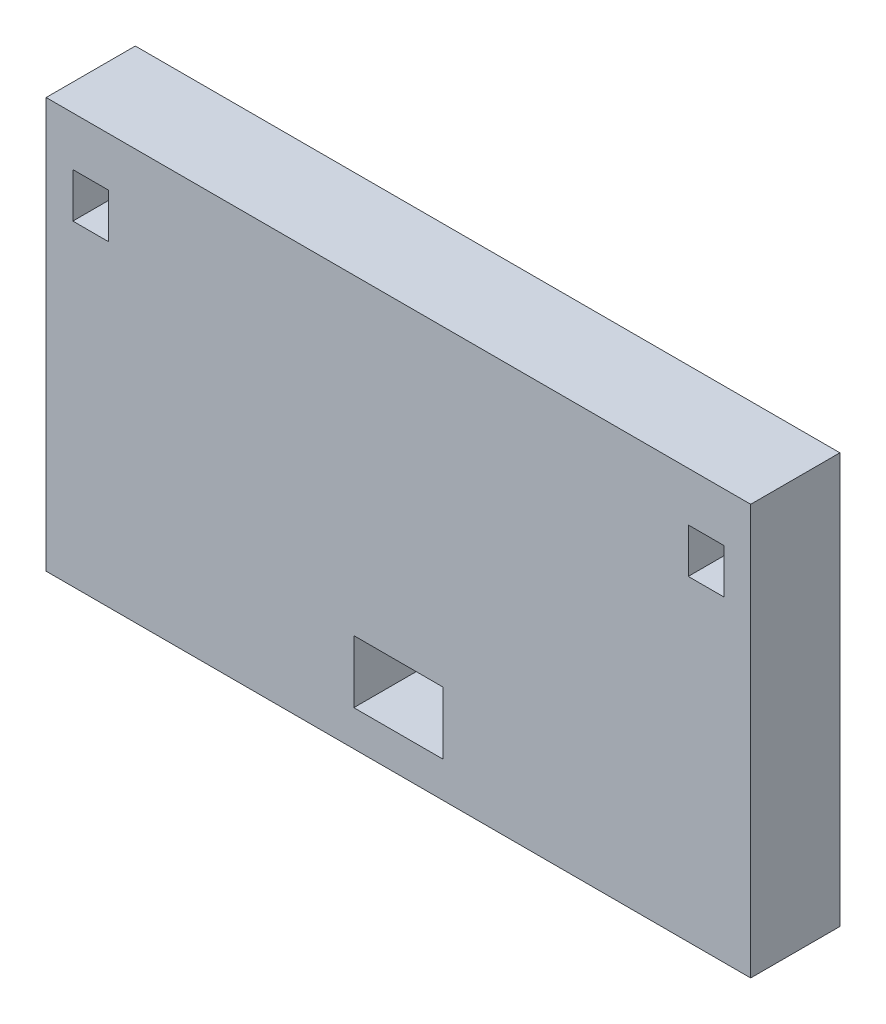
ISO-10303-21;
HEADER;
FILE_DESCRIPTION(('STEP AP214'),'2;1');
FILE_NAME('part.step','',(''),(''),'','','');
FILE_SCHEMA(('AUTOMOTIVE_DESIGN { 1 0 10303 214 1 1 1 1 }'));
ENDSEC;
DATA;
#1=APPLICATION_CONTEXT('core data for automotive mechanical design processes');
#2=APPLICATION_PROTOCOL_DEFINITION('international standard','automotive_design',2000,#1);
#3=PRODUCT_CONTEXT('',#1,'mechanical');
#4=PRODUCT('Part','Part','',(#3));
#5=PRODUCT_RELATED_PRODUCT_CATEGORY('part','',(#4));
#6=PRODUCT_DEFINITION_FORMATION('','',#4);
#7=PRODUCT_DEFINITION_CONTEXT('part definition',#1,'design');
#8=PRODUCT_DEFINITION('design','',#6,#7);
#9=PRODUCT_DEFINITION_SHAPE('','',#8);
#10=(LENGTH_UNIT() NAMED_UNIT(*) SI_UNIT(.MILLI.,.METRE.));
#11=(NAMED_UNIT(*) PLANE_ANGLE_UNIT() SI_UNIT($,.RADIAN.));
#12=(NAMED_UNIT(*) SI_UNIT($,.STERADIAN.) SOLID_ANGLE_UNIT());
#13=UNCERTAINTY_MEASURE_WITH_UNIT(LENGTH_MEASURE(1.E-05),#10,'distance_accuracy_value','');
#14=(GEOMETRIC_REPRESENTATION_CONTEXT(3) GLOBAL_UNCERTAINTY_ASSIGNED_CONTEXT((#13)) GLOBAL_UNIT_ASSIGNED_CONTEXT((#10,
#11,#12)) REPRESENTATION_CONTEXT('',''));
#15=CARTESIAN_POINT('',(0.,0.,0.));
#16=DIRECTION('',(0.,0.,1.));
#17=DIRECTION('',(1.,0.,0.));
#18=AXIS2_PLACEMENT_3D('',#15,#16,#17);
#19=CARTESIAN_POINT('',(0.,0.,10.));
#20=DIRECTION('',(0.,0.,-1.));
#21=DIRECTION('',(-1.,0.,0.));
#22=AXIS2_PLACEMENT_3D('',#19,#20,#21);
#23=PLANE('',#22);
#24=DIRECTION('',(0.,1.,0.));
#25=VECTOR('',#24,1.);
#26=CARTESIAN_POINT('',(36.5,33.1073700145429,10.));
#27=LINE('',#26,#25);
#28=CARTESIAN_POINT('',(36.5,33.1073700145429,10.));
#29=VERTEX_POINT('',#28);
#30=CARTESIAN_POINT('',(36.5,38.1073700145429,10.));
#31=VERTEX_POINT('',#30);
#32=EDGE_CURVE('E201',#29,#31,#27,.T.);
#33=ORIENTED_EDGE('',*,*,#32,.F.);
#34=DIRECTION('',(1.,0.,0.));
#35=VECTOR('',#34,1.);
#36=CARTESIAN_POINT('',(32.5,33.1073700145429,10.));
#37=LINE('',#36,#35);
#38=CARTESIAN_POINT('',(32.5,33.1073700145429,10.));
#39=VERTEX_POINT('',#38);
#40=EDGE_CURVE('E212',#39,#29,#37,.T.);
#41=ORIENTED_EDGE('',*,*,#40,.F.);
#42=DIRECTION('',(0.,-1.,0.));
#43=VECTOR('',#42,1.);
#44=CARTESIAN_POINT('',(32.5,33.1073700145429,10.));
#45=LINE('',#44,#43);
#46=CARTESIAN_POINT('',(32.5,38.1073700145429,10.));
#47=VERTEX_POINT('',#46);
#48=EDGE_CURVE('E208',#47,#39,#45,.T.);
#49=ORIENTED_EDGE('',*,*,#48,.F.);
#50=DIRECTION('',(-1.,0.,0.));
#51=VECTOR('',#50,1.);
#52=CARTESIAN_POINT('',(32.5,38.1073700145429,10.));
#53=LINE('',#52,#51);
#54=EDGE_CURVE('E204',#31,#47,#53,.T.);
#55=ORIENTED_EDGE('',*,*,#54,.F.);
#56=EDGE_LOOP('',(#33,#41,#49,#55));
#57=FACE_BOUND('',#56,.T.);
#58=DIRECTION('',(0.,-1.,0.));
#59=VECTOR('',#58,1.);
#60=CARTESIAN_POINT('',(-39.5,-2.38845773558347,10.));
#61=LINE('',#60,#59);
#62=CARTESIAN_POINT('',(-39.5,43.6115422644165,10.));
#63=VERTEX_POINT('',#62);
#64=CARTESIAN_POINT('',(-39.5,-2.38845773558347,10.));
#65=VERTEX_POINT('',#64);
#66=EDGE_CURVE('E287',#63,#65,#61,.T.);
#67=ORIENTED_EDGE('',*,*,#66,.T.);
#68=DIRECTION('',(1.,0.,0.));
#69=VECTOR('',#68,1.);
#70=CARTESIAN_POINT('',(-39.5,-2.38845773558347,10.));
#71=LINE('',#70,#69);
#72=CARTESIAN_POINT('',(39.5,-2.38845773558347,10.));
#73=VERTEX_POINT('',#72);
#74=EDGE_CURVE('E291',#65,#73,#71,.T.);
#75=ORIENTED_EDGE('',*,*,#74,.T.);
#76=DIRECTION('',(0.,1.,0.));
#77=VECTOR('',#76,1.);
#78=CARTESIAN_POINT('',(39.5,-2.38845773558347,10.));
#79=LINE('',#78,#77);
#80=CARTESIAN_POINT('',(39.5,43.6115422644166,10.));
#81=VERTEX_POINT('',#80);
#82=EDGE_CURVE('E295',#73,#81,#79,.T.);
#83=ORIENTED_EDGE('',*,*,#82,.T.);
#84=DIRECTION('',(-1.,0.,0.));
#85=VECTOR('',#84,1.);
#86=CARTESIAN_POINT('',(-39.5,43.6115422644165,10.));
#87=LINE('',#86,#85);
#88=EDGE_CURVE('E298',#81,#63,#87,.T.);
#89=ORIENTED_EDGE('',*,*,#88,.T.);
#90=EDGE_LOOP('',(#67,#75,#83,#89));
#91=FACE_BOUND('',#90,.T.);
#92=DIRECTION('',(0.,-1.,0.));
#93=VECTOR('',#92,1.);
#94=CARTESIAN_POINT('',(-5.,1.61154226441653,10.));
#95=LINE('',#94,#93);
#96=CARTESIAN_POINT('',(-5.,8.61154226441653,10.));
#97=VERTEX_POINT('',#96);
#98=CARTESIAN_POINT('',(-5.,1.61154226441653,10.));
#99=VERTEX_POINT('',#98);
#100=EDGE_CURVE('E244',#97,#99,#95,.T.);
#101=ORIENTED_EDGE('',*,*,#100,.F.);
#102=DIRECTION('',(-1.,0.,0.));
#103=VECTOR('',#102,1.);
#104=CARTESIAN_POINT('',(5.,8.61154226441653,10.));
#105=LINE('',#104,#103);
#106=CARTESIAN_POINT('',(5.,8.61154226441654,10.));
#107=VERTEX_POINT('',#106);
#108=EDGE_CURVE('E255',#107,#97,#105,.T.);
#109=ORIENTED_EDGE('',*,*,#108,.F.);
#110=DIRECTION('',(0.,1.,0.));
#111=VECTOR('',#110,1.);
#112=CARTESIAN_POINT('',(5.,1.61154226441654,10.));
#113=LINE('',#112,#111);
#114=CARTESIAN_POINT('',(5.,1.61154226441654,10.));
#115=VERTEX_POINT('',#114);
#116=EDGE_CURVE('E251',#115,#107,#113,.T.);
#117=ORIENTED_EDGE('',*,*,#116,.F.);
#118=DIRECTION('',(1.,0.,0.));
#119=VECTOR('',#118,1.);
#120=CARTESIAN_POINT('',(5.,1.61154226441654,10.));
#121=LINE('',#120,#119);
#122=EDGE_CURVE('E247',#99,#115,#121,.T.);
#123=ORIENTED_EDGE('',*,*,#122,.F.);
#124=EDGE_LOOP('',(#101,#109,#117,#123));
#125=FACE_BOUND('',#124,.T.);
#126=DIRECTION('',(0.,1.,0.));
#127=VECTOR('',#126,1.);
#128=CARTESIAN_POINT('',(-32.5,33.1073700145429,10.));
#129=LINE('',#128,#127);
#130=CARTESIAN_POINT('',(-32.5,33.1073700145429,10.));
#131=VERTEX_POINT('',#130);
#132=CARTESIAN_POINT('',(-32.5,38.1115422644165,10.));
#133=VERTEX_POINT('',#132);
#134=EDGE_CURVE('E153',#131,#133,#129,.T.);
#135=ORIENTED_EDGE('',*,*,#134,.F.);
#136=DIRECTION('',(0.999999456010787,-0.00104306190098296,0.));
#137=VECTOR('',#136,1.);
#138=CARTESIAN_POINT('',(-32.5,33.1073700145429,10.));
#139=LINE('',#138,#137);
#140=CARTESIAN_POINT('',(-36.5,33.1115422644165,10.));
#141=VERTEX_POINT('',#140);
#142=EDGE_CURVE('E179',#141,#131,#139,.T.);
#143=ORIENTED_EDGE('',*,*,#142,.F.);
#144=DIRECTION('',(0.,-1.,0.));
#145=VECTOR('',#144,1.);
#146=CARTESIAN_POINT('',(-36.5,33.1115422644165,10.));
#147=LINE('',#146,#145);
#148=CARTESIAN_POINT('',(-36.5,38.1115422644165,10.));
#149=VERTEX_POINT('',#148);
#150=EDGE_CURVE('E175',#149,#141,#147,.T.);
#151=ORIENTED_EDGE('',*,*,#150,.F.);
#152=DIRECTION('',(-1.,0.,0.));
#153=VECTOR('',#152,1.);
#154=CARTESIAN_POINT('',(-32.5,38.1115422644165,10.));
#155=LINE('',#154,#153);
#156=EDGE_CURVE('E162',#133,#149,#155,.T.);
#157=ORIENTED_EDGE('',*,*,#156,.F.);
#158=EDGE_LOOP('',(#135,#143,#151,#157));
#159=FACE_BOUND('',#158,.T.);
#160=ADVANCED_FACE('F39',(#57,#91,#125,#159),#23,.F.);
#161=CARTESIAN_POINT('',(0.,0.,0.));
#162=DIRECTION('',(0.,0.,-1.));
#163=DIRECTION('',(-1.,0.,0.));
#164=AXIS2_PLACEMENT_3D('',#161,#162,#163);
#165=PLANE('',#164);
#166=DIRECTION('',(0.,-1.,0.));
#167=VECTOR('',#166,1.);
#168=CARTESIAN_POINT('',(-39.5,-2.38845773558347,0.));
#169=LINE('',#168,#167);
#170=CARTESIAN_POINT('',(-39.5,43.6115422644165,0.));
#171=VERTEX_POINT('',#170);
#172=CARTESIAN_POINT('',(-39.5,-2.38845773558347,0.));
#173=VERTEX_POINT('',#172);
#174=EDGE_CURVE('E286',#171,#173,#169,.T.);
#175=ORIENTED_EDGE('',*,*,#174,.F.);
#176=DIRECTION('',(-1.,0.,0.));
#177=VECTOR('',#176,1.);
#178=CARTESIAN_POINT('',(-39.5,43.6115422644165,0.));
#179=LINE('',#178,#177);
#180=CARTESIAN_POINT('',(39.5,43.6115422644166,0.));
#181=VERTEX_POINT('',#180);
#182=EDGE_CURVE('E292',#181,#171,#179,.T.);
#183=ORIENTED_EDGE('',*,*,#182,.F.);
#184=DIRECTION('',(0.,1.,0.));
#185=VECTOR('',#184,1.);
#186=CARTESIAN_POINT('',(39.5,-2.38845773558347,0.));
#187=LINE('',#186,#185);
#188=CARTESIAN_POINT('',(39.5,-2.38845773558347,0.));
#189=VERTEX_POINT('',#188);
#190=EDGE_CURVE('E308',#189,#181,#187,.T.);
#191=ORIENTED_EDGE('',*,*,#190,.F.);
#192=DIRECTION('',(1.,0.,0.));
#193=VECTOR('',#192,1.);
#194=CARTESIAN_POINT('',(-39.5,-2.38845773558347,0.));
#195=LINE('',#194,#193);
#196=EDGE_CURVE('E305',#173,#189,#195,.T.);
#197=ORIENTED_EDGE('',*,*,#196,.F.);
#198=EDGE_LOOP('',(#175,#183,#191,#197));
#199=FACE_BOUND('',#198,.T.);
#200=DIRECTION('',(-1.,0.,0.));
#201=VECTOR('',#200,1.);
#202=CARTESIAN_POINT('',(5.,8.61154226441653,0.));
#203=LINE('',#202,#201);
#204=CARTESIAN_POINT('',(5.,8.61154226441653,0.));
#205=VERTEX_POINT('',#204);
#206=CARTESIAN_POINT('',(-5.,8.61154226441653,0.));
#207=VERTEX_POINT('',#206);
#208=EDGE_CURVE('E248',#205,#207,#203,.T.);
#209=ORIENTED_EDGE('',*,*,#208,.T.);
#210=DIRECTION('',(0.,-1.,0.));
#211=VECTOR('',#210,1.);
#212=CARTESIAN_POINT('',(-5.,1.61154226441653,0.));
#213=LINE('',#212,#211);
#214=CARTESIAN_POINT('',(-5.,1.61154226441653,0.));
#215=VERTEX_POINT('',#214);
#216=EDGE_CURVE('E243',#207,#215,#213,.T.);
#217=ORIENTED_EDGE('',*,*,#216,.T.);
#218=DIRECTION('',(1.,0.,0.));
#219=VECTOR('',#218,1.);
#220=CARTESIAN_POINT('',(5.,1.61154226441654,0.));
#221=LINE('',#220,#219);
#222=CARTESIAN_POINT('',(5.,1.61154226441654,0.));
#223=VERTEX_POINT('',#222);
#224=EDGE_CURVE('E262',#215,#223,#221,.T.);
#225=ORIENTED_EDGE('',*,*,#224,.T.);
#226=DIRECTION('',(0.,1.,0.));
#227=VECTOR('',#226,1.);
#228=CARTESIAN_POINT('',(5.,1.61154226441654,0.));
#229=LINE('',#228,#227);
#230=EDGE_CURVE('E266',#223,#205,#229,.T.);
#231=ORIENTED_EDGE('',*,*,#230,.T.);
#232=EDGE_LOOP('',(#209,#217,#225,#231));
#233=FACE_BOUND('',#232,.T.);
#234=DIRECTION('',(1.,0.,0.));
#235=VECTOR('',#234,1.);
#236=CARTESIAN_POINT('',(32.5,33.1073700145429,0.));
#237=LINE('',#236,#235);
#238=CARTESIAN_POINT('',(32.5,33.1073700145429,0.));
#239=VERTEX_POINT('',#238);
#240=CARTESIAN_POINT('',(36.5,33.1073700145429,0.));
#241=VERTEX_POINT('',#240);
#242=EDGE_CURVE('E205',#239,#241,#237,.T.);
#243=ORIENTED_EDGE('',*,*,#242,.T.);
#244=DIRECTION('',(0.,1.,0.));
#245=VECTOR('',#244,1.);
#246=CARTESIAN_POINT('',(36.5,33.1073700145429,0.));
#247=LINE('',#246,#245);
#248=CARTESIAN_POINT('',(36.5,38.1073700145429,0.));
#249=VERTEX_POINT('',#248);
#250=EDGE_CURVE('E171',#241,#249,#247,.T.);
#251=ORIENTED_EDGE('',*,*,#250,.T.);
#252=DIRECTION('',(-1.,0.,0.));
#253=VECTOR('',#252,1.);
#254=CARTESIAN_POINT('',(32.5,38.1073700145429,0.));
#255=LINE('',#254,#253);
#256=CARTESIAN_POINT('',(32.5,38.1073700145429,0.));
#257=VERTEX_POINT('',#256);
#258=EDGE_CURVE('E219',#249,#257,#255,.T.);
#259=ORIENTED_EDGE('',*,*,#258,.T.);
#260=DIRECTION('',(0.,-1.,0.));
#261=VECTOR('',#260,1.);
#262=CARTESIAN_POINT('',(32.5,33.1073700145429,0.));
#263=LINE('',#262,#261);
#264=EDGE_CURVE('E223',#257,#239,#263,.T.);
#265=ORIENTED_EDGE('',*,*,#264,.T.);
#266=EDGE_LOOP('',(#243,#251,#259,#265));
#267=FACE_BOUND('',#266,.T.);
#268=DIRECTION('',(0.999999456010787,-0.00104306190098296,0.));
#269=VECTOR('',#268,1.);
#270=CARTESIAN_POINT('',(-32.5,33.1073700145429,0.));
#271=LINE('',#270,#269);
#272=CARTESIAN_POINT('',(-36.5,33.1115422644165,0.));
#273=VERTEX_POINT('',#272);
#274=CARTESIAN_POINT('',(-32.5,33.1073700145429,0.));
#275=VERTEX_POINT('',#274);
#276=EDGE_CURVE('E163',#273,#275,#271,.T.);
#277=ORIENTED_EDGE('',*,*,#276,.T.);
#278=DIRECTION('',(0.,1.,0.));
#279=VECTOR('',#278,1.);
#280=CARTESIAN_POINT('',(-32.5,33.1073700145429,0.));
#281=LINE('',#280,#279);
#282=CARTESIAN_POINT('',(-32.5,38.1115422644165,0.));
#283=VERTEX_POINT('',#282);
#284=EDGE_CURVE('E63',#275,#283,#281,.T.);
#285=ORIENTED_EDGE('',*,*,#284,.T.);
#286=DIRECTION('',(-1.,0.,0.));
#287=VECTOR('',#286,1.);
#288=CARTESIAN_POINT('',(-32.5,38.1115422644165,0.));
#289=LINE('',#288,#287);
#290=CARTESIAN_POINT('',(-36.5,38.1115422644165,0.));
#291=VERTEX_POINT('',#290);
#292=EDGE_CURVE('E169',#283,#291,#289,.T.);
#293=ORIENTED_EDGE('',*,*,#292,.T.);
#294=DIRECTION('',(0.,-1.,0.));
#295=VECTOR('',#294,1.);
#296=CARTESIAN_POINT('',(-36.5,33.1115422644165,0.));
#297=LINE('',#296,#295);
#298=EDGE_CURVE('E188',#291,#273,#297,.T.);
#299=ORIENTED_EDGE('',*,*,#298,.T.);
#300=EDGE_LOOP('',(#277,#285,#293,#299));
#301=FACE_BOUND('',#300,.T.);
#302=ADVANCED_FACE('F331',(#199,#233,#267,#301),#165,.T.);
#303=CARTESIAN_POINT('',(-39.5,-2.38845773558347,10.));
#304=DIRECTION('',(1.,0.,0.));
#305=DIRECTION('',(0.,0.,-1.));
#306=AXIS2_PLACEMENT_3D('',#303,#304,#305);
#307=PLANE('',#306);
#308=ORIENTED_EDGE('',*,*,#174,.T.);
#309=DIRECTION('',(0.,0.,-1.));
#310=VECTOR('',#309,1.);
#311=CARTESIAN_POINT('',(-39.5,-2.38845773558347,10.));
#312=LINE('',#311,#310);
#313=EDGE_CURVE('E11',#65,#173,#312,.T.);
#314=ORIENTED_EDGE('',*,*,#313,.F.);
#315=ORIENTED_EDGE('',*,*,#66,.F.);
#316=DIRECTION('',(0.,0.,-1.));
#317=VECTOR('',#316,1.);
#318=CARTESIAN_POINT('',(-39.5,43.6115422644165,10.));
#319=LINE('',#318,#317);
#320=EDGE_CURVE('E301',#63,#171,#319,.T.);
#321=ORIENTED_EDGE('',*,*,#320,.T.);
#322=EDGE_LOOP('',(#308,#314,#315,#321));
#323=FACE_BOUND('',#322,.T.);
#324=ADVANCED_FACE('F41',(#323),#307,.F.);
#325=CARTESIAN_POINT('',(-39.5,-2.38845773558347,10.));
#326=DIRECTION('',(0.,1.,0.));
#327=DIRECTION('',(-1.,0.,0.));
#328=AXIS2_PLACEMENT_3D('',#325,#326,#327);
#329=PLANE('',#328);
#330=ORIENTED_EDGE('',*,*,#196,.T.);
#331=DIRECTION('',(0.,0.,-1.));
#332=VECTOR('',#331,1.);
#333=CARTESIAN_POINT('',(39.5,-2.38845773558347,10.));
#334=LINE('',#333,#332);
#335=EDGE_CURVE('E48',#73,#189,#334,.T.);
#336=ORIENTED_EDGE('',*,*,#335,.F.);
#337=ORIENTED_EDGE('',*,*,#74,.F.);
#338=ORIENTED_EDGE('',*,*,#313,.T.);
#339=EDGE_LOOP('',(#330,#336,#337,#338));
#340=FACE_BOUND('',#339,.T.);
#341=ADVANCED_FACE('F342',(#340),#329,.F.);
#342=CARTESIAN_POINT('',(39.5,-2.38845773558347,10.));
#343=DIRECTION('',(-1.,0.,0.));
#344=DIRECTION('',(0.,0.,1.));
#345=AXIS2_PLACEMENT_3D('',#342,#343,#344);
#346=PLANE('',#345);
#347=ORIENTED_EDGE('',*,*,#190,.T.);
#348=DIRECTION('',(0.,0.,-1.));
#349=VECTOR('',#348,1.);
#350=CARTESIAN_POINT('',(39.5,43.6115422644166,10.));
#351=LINE('',#350,#349);
#352=EDGE_CURVE('E316',#81,#181,#351,.T.);
#353=ORIENTED_EDGE('',*,*,#352,.F.);
#354=ORIENTED_EDGE('',*,*,#82,.F.);
#355=ORIENTED_EDGE('',*,*,#335,.T.);
#356=EDGE_LOOP('',(#347,#353,#354,#355));
#357=FACE_BOUND('',#356,.T.);
#358=ADVANCED_FACE('F325',(#357),#346,.F.);
#359=CARTESIAN_POINT('',(-39.5,43.6115422644165,10.));
#360=DIRECTION('',(0.,-1.,0.));
#361=DIRECTION('',(1.,0.,0.));
#362=AXIS2_PLACEMENT_3D('',#359,#360,#361);
#363=PLANE('',#362);
#364=ORIENTED_EDGE('',*,*,#182,.T.);
#365=ORIENTED_EDGE('',*,*,#320,.F.);
#366=ORIENTED_EDGE('',*,*,#88,.F.);
#367=ORIENTED_EDGE('',*,*,#352,.T.);
#368=EDGE_LOOP('',(#364,#365,#366,#367));
#369=FACE_BOUND('',#368,.T.);
#370=ADVANCED_FACE('F335',(#369),#363,.F.);
#371=CARTESIAN_POINT('',(-5.,1.61154226441653,10.));
#372=DIRECTION('',(1.,0.,0.));
#373=DIRECTION('',(0.,0.,-1.));
#374=AXIS2_PLACEMENT_3D('',#371,#372,#373);
#375=PLANE('',#374);
#376=ORIENTED_EDGE('',*,*,#216,.F.);
#377=DIRECTION('',(0.,0.,-1.));
#378=VECTOR('',#377,1.);
#379=CARTESIAN_POINT('',(-5.,8.61154226441653,10.));
#380=LINE('',#379,#378);
#381=EDGE_CURVE('E258',#97,#207,#380,.T.);
#382=ORIENTED_EDGE('',*,*,#381,.F.);
#383=ORIENTED_EDGE('',*,*,#100,.T.);
#384=DIRECTION('',(0.,0.,-1.));
#385=VECTOR('',#384,1.);
#386=CARTESIAN_POINT('',(-5.,1.61154226441653,10.));
#387=LINE('',#386,#385);
#388=EDGE_CURVE('E282',#99,#215,#387,.T.);
#389=ORIENTED_EDGE('',*,*,#388,.T.);
#390=EDGE_LOOP('',(#376,#382,#383,#389));
#391=FACE_BOUND('',#390,.T.);
#392=ADVANCED_FACE('F358',(#391),#375,.T.);
#393=CARTESIAN_POINT('',(5.,1.61154226441654,10.));
#394=DIRECTION('',(0.,1.,0.));
#395=DIRECTION('',(-1.,0.,0.));
#396=AXIS2_PLACEMENT_3D('',#393,#394,#395);
#397=PLANE('',#396);
#398=ORIENTED_EDGE('',*,*,#224,.F.);
#399=ORIENTED_EDGE('',*,*,#388,.F.);
#400=ORIENTED_EDGE('',*,*,#122,.T.);
#401=DIRECTION('',(0.,0.,-1.));
#402=VECTOR('',#401,1.);
#403=CARTESIAN_POINT('',(5.,1.61154226441654,10.));
#404=LINE('',#403,#402);
#405=EDGE_CURVE('E279',#115,#223,#404,.T.);
#406=ORIENTED_EDGE('',*,*,#405,.T.);
#407=EDGE_LOOP('',(#398,#399,#400,#406));
#408=FACE_BOUND('',#407,.T.);
#409=ADVANCED_FACE('F365',(#408),#397,.T.);
#410=CARTESIAN_POINT('',(5.,1.61154226441654,10.));
#411=DIRECTION('',(-1.,0.,0.));
#412=DIRECTION('',(0.,0.,1.));
#413=AXIS2_PLACEMENT_3D('',#410,#411,#412);
#414=PLANE('',#413);
#415=ORIENTED_EDGE('',*,*,#230,.F.);
#416=ORIENTED_EDGE('',*,*,#405,.F.);
#417=ORIENTED_EDGE('',*,*,#116,.T.);
#418=DIRECTION('',(0.,0.,-1.));
#419=VECTOR('',#418,1.);
#420=CARTESIAN_POINT('',(5.,8.61154226441653,10.));
#421=LINE('',#420,#419);
#422=EDGE_CURVE('E276',#107,#205,#421,.T.);
#423=ORIENTED_EDGE('',*,*,#422,.T.);
#424=EDGE_LOOP('',(#415,#416,#417,#423));
#425=FACE_BOUND('',#424,.T.);
#426=ADVANCED_FACE('F370',(#425),#414,.T.);
#427=CARTESIAN_POINT('',(5.,8.61154226441653,10.));
#428=DIRECTION('',(0.,-1.,0.));
#429=DIRECTION('',(1.,0.,0.));
#430=AXIS2_PLACEMENT_3D('',#427,#428,#429);
#431=PLANE('',#430);
#432=ORIENTED_EDGE('',*,*,#208,.F.);
#433=ORIENTED_EDGE('',*,*,#422,.F.);
#434=ORIENTED_EDGE('',*,*,#108,.T.);
#435=ORIENTED_EDGE('',*,*,#381,.T.);
#436=EDGE_LOOP('',(#432,#433,#434,#435));
#437=FACE_BOUND('',#436,.T.);
#438=ADVANCED_FACE('F377',(#437),#431,.T.);
#439=CARTESIAN_POINT('',(36.5,33.1073700145429,10.));
#440=DIRECTION('',(-1.,0.,0.));
#441=DIRECTION('',(0.,0.,1.));
#442=AXIS2_PLACEMENT_3D('',#439,#440,#441);
#443=PLANE('',#442);
#444=ORIENTED_EDGE('',*,*,#250,.F.);
#445=DIRECTION('',(0.,0.,-1.));
#446=VECTOR('',#445,1.);
#447=CARTESIAN_POINT('',(36.5,33.1073700145429,10.));
#448=LINE('',#447,#446);
#449=EDGE_CURVE('E215',#29,#241,#448,.T.);
#450=ORIENTED_EDGE('',*,*,#449,.F.);
#451=ORIENTED_EDGE('',*,*,#32,.T.);
#452=DIRECTION('',(0.,0.,-1.));
#453=VECTOR('',#452,1.);
#454=CARTESIAN_POINT('',(36.5,38.1073700145429,10.));
#455=LINE('',#454,#453);
#456=EDGE_CURVE('E239',#31,#249,#455,.T.);
#457=ORIENTED_EDGE('',*,*,#456,.T.);
#458=EDGE_LOOP('',(#444,#450,#451,#457));
#459=FACE_BOUND('',#458,.T.);
#460=ADVANCED_FACE('F390',(#459),#443,.T.);
#461=CARTESIAN_POINT('',(32.5,38.1073700145429,10.));
#462=DIRECTION('',(0.,-1.,0.));
#463=DIRECTION('',(0.,0.,-1.));
#464=AXIS2_PLACEMENT_3D('',#461,#462,#463);
#465=PLANE('',#464);
#466=ORIENTED_EDGE('',*,*,#258,.F.);
#467=ORIENTED_EDGE('',*,*,#456,.F.);
#468=ORIENTED_EDGE('',*,*,#54,.T.);
#469=DIRECTION('',(0.,0.,-1.));
#470=VECTOR('',#469,1.);
#471=CARTESIAN_POINT('',(32.5,38.1073700145429,10.));
#472=LINE('',#471,#470);
#473=EDGE_CURVE('E236',#47,#257,#472,.T.);
#474=ORIENTED_EDGE('',*,*,#473,.T.);
#475=EDGE_LOOP('',(#466,#467,#468,#474));
#476=FACE_BOUND('',#475,.T.);
#477=ADVANCED_FACE('F395',(#476),#465,.T.);
#478=CARTESIAN_POINT('',(32.5,33.1073700145429,10.));
#479=DIRECTION('',(1.,0.,0.));
#480=DIRECTION('',(0.,0.,-1.));
#481=AXIS2_PLACEMENT_3D('',#478,#479,#480);
#482=PLANE('',#481);
#483=ORIENTED_EDGE('',*,*,#264,.F.);
#484=ORIENTED_EDGE('',*,*,#473,.F.);
#485=ORIENTED_EDGE('',*,*,#48,.T.);
#486=DIRECTION('',(0.,0.,-1.));
#487=VECTOR('',#486,1.);
#488=CARTESIAN_POINT('',(32.5,33.1073700145429,10.));
#489=LINE('',#488,#487);
#490=EDGE_CURVE('E233',#39,#239,#489,.T.);
#491=ORIENTED_EDGE('',*,*,#490,.T.);
#492=EDGE_LOOP('',(#483,#484,#485,#491));
#493=FACE_BOUND('',#492,.T.);
#494=ADVANCED_FACE('F399',(#493),#482,.T.);
#495=CARTESIAN_POINT('',(32.5,33.1073700145429,10.));
#496=DIRECTION('',(0.,1.,0.));
#497=DIRECTION('',(0.,0.,1.));
#498=AXIS2_PLACEMENT_3D('',#495,#496,#497);
#499=PLANE('',#498);
#500=ORIENTED_EDGE('',*,*,#242,.F.);
#501=ORIENTED_EDGE('',*,*,#490,.F.);
#502=ORIENTED_EDGE('',*,*,#40,.T.);
#503=ORIENTED_EDGE('',*,*,#449,.T.);
#504=EDGE_LOOP('',(#500,#501,#502,#503));
#505=FACE_BOUND('',#504,.T.);
#506=ADVANCED_FACE('F403',(#505),#499,.T.);
#507=CARTESIAN_POINT('',(-32.5,33.1073700145429,10.));
#508=DIRECTION('',(-1.,0.,0.));
#509=DIRECTION('',(0.,0.,1.));
#510=AXIS2_PLACEMENT_3D('',#507,#508,#509);
#511=PLANE('',#510);
#512=ORIENTED_EDGE('',*,*,#284,.F.);
#513=DIRECTION('',(0.,0.,-1.));
#514=VECTOR('',#513,1.);
#515=CARTESIAN_POINT('',(-32.5,33.1073700145429,10.));
#516=LINE('',#515,#514);
#517=EDGE_CURVE('E157',#131,#275,#516,.T.);
#518=ORIENTED_EDGE('',*,*,#517,.F.);
#519=ORIENTED_EDGE('',*,*,#134,.T.);
#520=DIRECTION('',(0.,0.,-1.));
#521=VECTOR('',#520,1.);
#522=CARTESIAN_POINT('',(-32.5,38.1115422644165,10.));
#523=LINE('',#522,#521);
#524=EDGE_CURVE('E156',#133,#283,#523,.T.);
#525=ORIENTED_EDGE('',*,*,#524,.T.);
#526=EDGE_LOOP('',(#512,#518,#519,#525));
#527=FACE_BOUND('',#526,.T.);
#528=ADVANCED_FACE('F155',(#527),#511,.T.);
#529=CARTESIAN_POINT('',(-32.5,38.1115422644165,10.));
#530=DIRECTION('',(0.,-1.,0.));
#531=DIRECTION('',(0.,0.,-1.));
#532=AXIS2_PLACEMENT_3D('',#529,#530,#531);
#533=PLANE('',#532);
#534=ORIENTED_EDGE('',*,*,#292,.F.);
#535=ORIENTED_EDGE('',*,*,#524,.F.);
#536=ORIENTED_EDGE('',*,*,#156,.T.);
#537=DIRECTION('',(0.,0.,-1.));
#538=VECTOR('',#537,1.);
#539=CARTESIAN_POINT('',(-36.5,38.1115422644165,10.));
#540=LINE('',#539,#538);
#541=EDGE_CURVE('E172',#149,#291,#540,.T.);
#542=ORIENTED_EDGE('',*,*,#541,.T.);
#543=EDGE_LOOP('',(#534,#535,#536,#542));
#544=FACE_BOUND('',#543,.T.);
#545=ADVANCED_FACE('F166',(#544),#533,.T.);
#546=CARTESIAN_POINT('',(-36.5,33.1115422644165,10.));
#547=DIRECTION('',(1.,0.,0.));
#548=DIRECTION('',(0.,0.,-1.));
#549=AXIS2_PLACEMENT_3D('',#546,#547,#548);
#550=PLANE('',#549);
#551=ORIENTED_EDGE('',*,*,#298,.F.);
#552=ORIENTED_EDGE('',*,*,#541,.F.);
#553=ORIENTED_EDGE('',*,*,#150,.T.);
#554=DIRECTION('',(0.,0.,-1.));
#555=VECTOR('',#554,1.);
#556=CARTESIAN_POINT('',(-36.5,33.1115422644165,10.));
#557=LINE('',#556,#555);
#558=EDGE_CURVE('E55',#141,#273,#557,.T.);
#559=ORIENTED_EDGE('',*,*,#558,.T.);
#560=EDGE_LOOP('',(#551,#552,#553,#559));
#561=FACE_BOUND('',#560,.T.);
#562=ADVANCED_FACE('F412',(#561),#550,.T.);
#563=CARTESIAN_POINT('',(-32.5,33.1073700145429,10.));
#564=DIRECTION('',(0.00104306190098296,0.999999456010787,0.));
#565=DIRECTION('',(-0.999999456010787,0.00104306190098296,0.));
#566=AXIS2_PLACEMENT_3D('',#563,#564,#565);
#567=PLANE('',#566);
#568=ORIENTED_EDGE('',*,*,#276,.F.);
#569=ORIENTED_EDGE('',*,*,#558,.F.);
#570=ORIENTED_EDGE('',*,*,#142,.T.);
#571=ORIENTED_EDGE('',*,*,#517,.T.);
#572=EDGE_LOOP('',(#568,#569,#570,#571));
#573=FACE_BOUND('',#572,.T.);
#574=ADVANCED_FACE('F415',(#573),#567,.T.);
#575=CLOSED_SHELL('',(#160,#302,#324,#341,#358,#370,#392,#409,#426,#438,#460,#477,#494,#506,
#528,#545,#562,#574));
#576=MANIFOLD_SOLID_BREP('B2',#575);
#577=ADVANCED_BREP_SHAPE_REPRESENTATION('',(#18,#576),#14);
#578=SHAPE_DEFINITION_REPRESENTATION(#9,#577);
ENDSEC;
END-ISO-10303-21;
